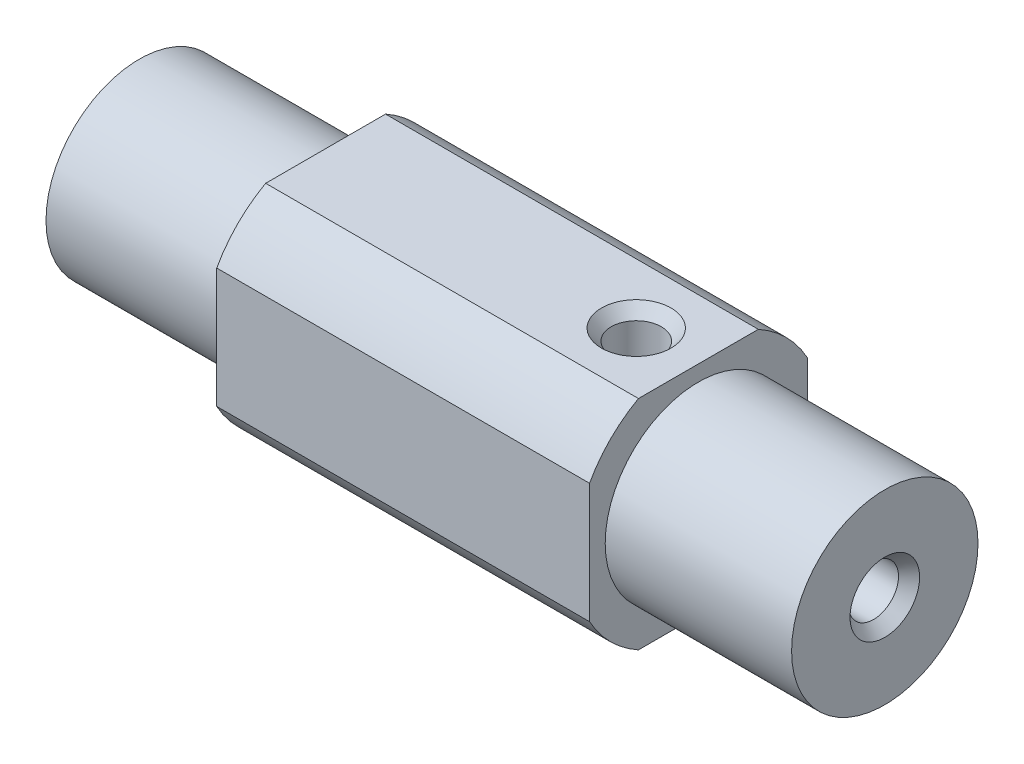
ISO-10303-21;
HEADER;
FILE_DESCRIPTION(('STEP AP214'),'2;1');
FILE_NAME('part.step','',(''),(''),'','','');
FILE_SCHEMA(('AUTOMOTIVE_DESIGN { 1 0 10303 214 1 1 1 1 }'));
ENDSEC;
DATA;
#1=APPLICATION_CONTEXT('core data for automotive mechanical design processes');
#2=APPLICATION_PROTOCOL_DEFINITION('international standard','automotive_design',2000,#1);
#3=PRODUCT_CONTEXT('',#1,'mechanical');
#4=PRODUCT('Part','Part','',(#3));
#5=PRODUCT_RELATED_PRODUCT_CATEGORY('part','',(#4));
#6=PRODUCT_DEFINITION_FORMATION('','',#4);
#7=PRODUCT_DEFINITION_CONTEXT('part definition',#1,'design');
#8=PRODUCT_DEFINITION('design','',#6,#7);
#9=PRODUCT_DEFINITION_SHAPE('','',#8);
#10=(LENGTH_UNIT() NAMED_UNIT(*) SI_UNIT(.MILLI.,.METRE.));
#11=(NAMED_UNIT(*) PLANE_ANGLE_UNIT() SI_UNIT($,.RADIAN.));
#12=(NAMED_UNIT(*) SI_UNIT($,.STERADIAN.) SOLID_ANGLE_UNIT());
#13=UNCERTAINTY_MEASURE_WITH_UNIT(LENGTH_MEASURE(1.E-05),#10,'distance_accuracy_value','');
#14=(GEOMETRIC_REPRESENTATION_CONTEXT(3) GLOBAL_UNCERTAINTY_ASSIGNED_CONTEXT((#13)) GLOBAL_UNIT_ASSIGNED_CONTEXT((#10,
#11,#12)) REPRESENTATION_CONTEXT('',''));
#15=CARTESIAN_POINT('',(0.,0.,0.));
#16=DIRECTION('',(0.,0.,1.));
#17=DIRECTION('',(1.,0.,0.));
#18=AXIS2_PLACEMENT_3D('',#15,#16,#17);
#19=CARTESIAN_POINT('',(-79.375,0.,0.));
#20=DIRECTION('',(1.,0.,0.));
#21=DIRECTION('',(0.,0.,-1.));
#22=AXIS2_PLACEMENT_3D('',#19,#20,#21);
#23=CYLINDRICAL_SURFACE('',#22,12.7);
#24=DIRECTION('',(1.,0.,0.));
#25=VECTOR('',#24,1.);
#26=CARTESIAN_POINT('',(-79.375,-6.12535100708523,11.1252));
#27=LINE('',#26,#25);
#28=CARTESIAN_POINT('',(-19.05,-6.12535100708523,11.1252));
#29=VERTEX_POINT('',#28);
#30=CARTESIAN_POINT('',(-57.15,-6.12535100708523,11.1252));
#31=VERTEX_POINT('',#30);
#32=EDGE_CURVE('E205',#29,#31,#27,.F.);
#33=ORIENTED_EDGE('',*,*,#32,.T.);
#34=CARTESIAN_POINT('',(-57.15,0.,0.));
#35=DIRECTION('',(-1.,0.,0.));
#36=DIRECTION('',(0.,0.,1.));
#37=AXIS2_PLACEMENT_3D('',#34,#35,#36);
#38=CIRCLE('',#37,12.7);
#39=CARTESIAN_POINT('',(-57.15,-11.1252,6.12535100708522));
#40=VERTEX_POINT('',#39);
#41=EDGE_CURVE('E154',#31,#40,#38,.F.);
#42=ORIENTED_EDGE('',*,*,#41,.T.);
#43=DIRECTION('',(1.,0.,0.));
#44=VECTOR('',#43,1.);
#45=CARTESIAN_POINT('',(-79.375,-11.1252,6.12535100708522));
#46=LINE('',#45,#44);
#47=CARTESIAN_POINT('',(-19.05,-11.1252,6.12535100708522));
#48=VERTEX_POINT('',#47);
#49=EDGE_CURVE('E177',#48,#40,#46,.F.);
#50=ORIENTED_EDGE('',*,*,#49,.F.);
#51=CARTESIAN_POINT('',(-19.05,0.,0.));
#52=DIRECTION('',(1.,0.,0.));
#53=DIRECTION('',(0.,0.,-1.));
#54=AXIS2_PLACEMENT_3D('',#51,#52,#53);
#55=CIRCLE('',#54,12.7);
#56=EDGE_CURVE('E212',#48,#29,#55,.F.);
#57=ORIENTED_EDGE('',*,*,#56,.T.);
#58=EDGE_LOOP('',(#33,#42,#50,#57));
#59=FACE_BOUND('',#58,.T.);
#60=ADVANCED_FACE('F48',(#59),#23,.T.);
#61=DIRECTION('',(1.,0.,0.));
#62=VECTOR('',#61,1.);
#63=CARTESIAN_POINT('',(-79.375,-11.1252,-6.12535100708522));
#64=LINE('',#63,#62);
#65=CARTESIAN_POINT('',(-57.15,-11.1252,-6.12535100708522));
#66=VERTEX_POINT('',#65);
#67=CARTESIAN_POINT('',(-19.05,-11.1252,-6.12535100708522));
#68=VERTEX_POINT('',#67);
#69=EDGE_CURVE('E68',#66,#68,#64,.T.);
#70=ORIENTED_EDGE('',*,*,#69,.F.);
#71=CARTESIAN_POINT('',(-57.15,0.,0.));
#72=DIRECTION('',(-1.,0.,0.));
#73=DIRECTION('',(0.,0.,1.));
#74=AXIS2_PLACEMENT_3D('',#71,#72,#73);
#75=CIRCLE('',#74,12.7);
#76=CARTESIAN_POINT('',(-57.15,-6.12535100708522,-11.1252));
#77=VERTEX_POINT('',#76);
#78=EDGE_CURVE('E61',#66,#77,#75,.F.);
#79=ORIENTED_EDGE('',*,*,#78,.T.);
#80=DIRECTION('',(1.,0.,0.));
#81=VECTOR('',#80,1.);
#82=CARTESIAN_POINT('',(-79.375,-6.12535100708522,-11.1252));
#83=LINE('',#82,#81);
#84=CARTESIAN_POINT('',(-19.05,-6.12535100708522,-11.1252));
#85=VERTEX_POINT('',#84);
#86=EDGE_CURVE('E173',#85,#77,#83,.F.);
#87=ORIENTED_EDGE('',*,*,#86,.F.);
#88=EDGE_CURVE('E238',#85,#68,#55,.F.);
#89=ORIENTED_EDGE('',*,*,#88,.T.);
#90=EDGE_LOOP('',(#70,#79,#87,#89));
#91=FACE_BOUND('',#90,.T.);
#92=ADVANCED_FACE('F252',(#91),#23,.T.);
#93=DIRECTION('',(1.,0.,0.));
#94=VECTOR('',#93,1.);
#95=CARTESIAN_POINT('',(-79.375,11.1252,6.12535100708523));
#96=LINE('',#95,#94);
#97=CARTESIAN_POINT('',(-19.05,11.1252,6.12535100708523));
#98=VERTEX_POINT('',#97);
#99=CARTESIAN_POINT('',(-57.15,11.1252,6.12535100708523));
#100=VERTEX_POINT('',#99);
#101=EDGE_CURVE('E200',#98,#100,#96,.F.);
#102=ORIENTED_EDGE('',*,*,#101,.T.);
#103=CARTESIAN_POINT('',(-57.15,0.,0.));
#104=DIRECTION('',(-1.,0.,0.));
#105=DIRECTION('',(0.,0.,1.));
#106=AXIS2_PLACEMENT_3D('',#103,#104,#105);
#107=CIRCLE('',#106,12.7);
#108=CARTESIAN_POINT('',(-57.15,6.12535100708522,11.1252));
#109=VERTEX_POINT('',#108);
#110=EDGE_CURVE('E165',#100,#109,#107,.F.);
#111=ORIENTED_EDGE('',*,*,#110,.T.);
#112=DIRECTION('',(1.,0.,0.));
#113=VECTOR('',#112,1.);
#114=CARTESIAN_POINT('',(-79.375,6.12535100708523,11.1252));
#115=LINE('',#114,#113);
#116=CARTESIAN_POINT('',(-19.05,6.12535100708523,11.1252));
#117=VERTEX_POINT('',#116);
#118=EDGE_CURVE('E203',#109,#117,#115,.T.);
#119=ORIENTED_EDGE('',*,*,#118,.T.);
#120=EDGE_CURVE('E215',#117,#98,#55,.F.);
#121=ORIENTED_EDGE('',*,*,#120,.T.);
#122=EDGE_LOOP('',(#102,#111,#119,#121));
#123=FACE_BOUND('',#122,.T.);
#124=ADVANCED_FACE('F254',(#123),#23,.T.);
#125=DIRECTION('',(1.,0.,0.));
#126=VECTOR('',#125,1.);
#127=CARTESIAN_POINT('',(-79.375,6.12535100708523,-11.1252));
#128=LINE('',#127,#126);
#129=CARTESIAN_POINT('',(-57.15,6.12535100708523,-11.1252));
#130=VERTEX_POINT('',#129);
#131=CARTESIAN_POINT('',(-19.05,6.12535100708523,-11.1252));
#132=VERTEX_POINT('',#131);
#133=EDGE_CURVE('E171',#130,#132,#128,.T.);
#134=ORIENTED_EDGE('',*,*,#133,.F.);
#135=CARTESIAN_POINT('',(-57.15,0.,0.));
#136=DIRECTION('',(-1.,0.,0.));
#137=DIRECTION('',(0.,0.,1.));
#138=AXIS2_PLACEMENT_3D('',#135,#136,#137);
#139=CIRCLE('',#138,12.7);
#140=CARTESIAN_POINT('',(-57.15,11.1252,-6.12535100708523));
#141=VERTEX_POINT('',#140);
#142=EDGE_CURVE('E162',#130,#141,#139,.F.);
#143=ORIENTED_EDGE('',*,*,#142,.T.);
#144=DIRECTION('',(1.,0.,0.));
#145=VECTOR('',#144,1.);
#146=CARTESIAN_POINT('',(-79.375,11.1252,-6.12535100708523));
#147=LINE('',#146,#145);
#148=CARTESIAN_POINT('',(-19.05,11.1252,-6.12535100708523));
#149=VERTEX_POINT('',#148);
#150=EDGE_CURVE('E198',#141,#149,#147,.T.);
#151=ORIENTED_EDGE('',*,*,#150,.T.);
#152=EDGE_CURVE('E219',#149,#132,#55,.F.);
#153=ORIENTED_EDGE('',*,*,#152,.T.);
#154=EDGE_LOOP('',(#134,#143,#151,#153));
#155=FACE_BOUND('',#154,.T.);
#156=ADVANCED_FACE('F245',(#155),#23,.T.);
#157=CARTESIAN_POINT('',(-91.2436173816218,-25.5220707846333,11.1252));
#158=DIRECTION('',(0.,0.,1.));
#159=DIRECTION('',(1.,0.,0.));
#160=AXIS2_PLACEMENT_3D('',#157,#158,#159);
#161=PLANE('',#160);
#162=ORIENTED_EDGE('',*,*,#118,.F.);
#163=DIRECTION('',(0.,-1.,0.));
#164=VECTOR('',#163,1.);
#165=CARTESIAN_POINT('',(-57.15,-25.5220707846333,11.1252));
#166=LINE('',#165,#164);
#167=EDGE_CURVE('E159',#109,#31,#166,.T.);
#168=ORIENTED_EDGE('',*,*,#167,.T.);
#169=ORIENTED_EDGE('',*,*,#32,.F.);
#170=DIRECTION('',(0.,-1.,0.));
#171=VECTOR('',#170,1.);
#172=CARTESIAN_POINT('',(-19.05,0.,11.1252));
#173=LINE('',#172,#171);
#174=EDGE_CURVE('E218',#117,#29,#173,.T.);
#175=ORIENTED_EDGE('',*,*,#174,.F.);
#176=EDGE_LOOP('',(#162,#168,#169,#175));
#177=FACE_BOUND('',#176,.T.);
#178=ADVANCED_FACE('F263',(#177),#161,.T.);
#179=CARTESIAN_POINT('',(-96.4133134907001,11.1252,24.8096946684768));
#180=DIRECTION('',(0.,1.,0.));
#181=DIRECTION('',(0.,0.,1.));
#182=AXIS2_PLACEMENT_3D('',#179,#180,#181);
#183=PLANE('',#182);
#184=CARTESIAN_POINT('',(-25.4,11.1252000000001,0.));
#185=DIRECTION('',(0.,1.,0.));
#186=DIRECTION('',(0.,0.,1.));
#187=AXIS2_PLACEMENT_3D('',#184,#185,#186);
#188=CIRCLE('',#187,3.55599999999989);
#189=CARTESIAN_POINT('',(-25.4,11.1252000000001,3.55599999999989));
#190=VERTEX_POINT('',#189);
#191=EDGE_CURVE('E189',#190,#190,#188,.T.);
#192=ORIENTED_EDGE('',*,*,#191,.F.);
#193=EDGE_LOOP('',(#192));
#194=FACE_BOUND('',#193,.T.);
#195=ORIENTED_EDGE('',*,*,#150,.F.);
#196=DIRECTION('',(0.,0.,1.));
#197=VECTOR('',#196,1.);
#198=CARTESIAN_POINT('',(-57.15,11.1252,24.8096946684768));
#199=LINE('',#198,#197);
#200=EDGE_CURVE('E168',#141,#100,#199,.T.);
#201=ORIENTED_EDGE('',*,*,#200,.T.);
#202=ORIENTED_EDGE('',*,*,#101,.F.);
#203=DIRECTION('',(0.,0.,1.));
#204=VECTOR('',#203,1.);
#205=CARTESIAN_POINT('',(-19.05,11.1252,0.));
#206=LINE('',#205,#204);
#207=EDGE_CURVE('E222',#149,#98,#206,.T.);
#208=ORIENTED_EDGE('',*,*,#207,.F.);
#209=EDGE_LOOP('',(#195,#201,#202,#208));
#210=FACE_BOUND('',#209,.T.);
#211=ADVANCED_FACE('F267',(#194,#210),#183,.T.);
#212=CARTESIAN_POINT('',(-88.9,12.0776267868952,-11.1252));
#213=DIRECTION('',(0.,0.,1.));
#214=DIRECTION('',(0.,-1.,0.));
#215=AXIS2_PLACEMENT_3D('',#212,#213,#214);
#216=PLANE('',#215);
#217=DIRECTION('',(0.,-1.,0.));
#218=VECTOR('',#217,1.);
#219=CARTESIAN_POINT('',(-57.15,12.0776267868952,-11.1252));
#220=LINE('',#219,#218);
#221=EDGE_CURVE('E157',#130,#77,#220,.T.);
#222=ORIENTED_EDGE('',*,*,#221,.F.);
#223=ORIENTED_EDGE('',*,*,#133,.T.);
#224=DIRECTION('',(0.,-1.,0.));
#225=VECTOR('',#224,1.);
#226=CARTESIAN_POINT('',(-19.05,0.,-11.1252));
#227=LINE('',#226,#225);
#228=EDGE_CURVE('E225',#132,#85,#227,.T.);
#229=ORIENTED_EDGE('',*,*,#228,.T.);
#230=ORIENTED_EDGE('',*,*,#86,.T.);
#231=EDGE_LOOP('',(#222,#223,#229,#230));
#232=FACE_BOUND('',#231,.T.);
#233=ADVANCED_FACE('F251',(#232),#216,.F.);
#234=CARTESIAN_POINT('',(-88.9,-11.1252,14.1212392114396));
#235=DIRECTION('',(0.,1.,0.));
#236=DIRECTION('',(0.,0.,1.));
#237=AXIS2_PLACEMENT_3D('',#234,#235,#236);
#238=PLANE('',#237);
#239=CARTESIAN_POINT('',(-50.8,-11.1252,0.));
#240=DIRECTION('',(0.,-1.,0.));
#241=DIRECTION('',(0.,0.,-1.));
#242=AXIS2_PLACEMENT_3D('',#239,#240,#241);
#243=CIRCLE('',#242,3.556);
#244=CARTESIAN_POINT('',(-50.8,-11.1252,-3.55600000000001));
#245=VERTEX_POINT('',#244);
#246=EDGE_CURVE('E138',#245,#245,#243,.T.);
#247=ORIENTED_EDGE('',*,*,#246,.F.);
#248=EDGE_LOOP('',(#247));
#249=FACE_BOUND('',#248,.T.);
#250=DIRECTION('',(0.,0.,1.));
#251=VECTOR('',#250,1.);
#252=CARTESIAN_POINT('',(-57.15,-11.1252,14.1212392114396));
#253=LINE('',#252,#251);
#254=EDGE_CURVE('E13',#66,#40,#253,.T.);
#255=ORIENTED_EDGE('',*,*,#254,.F.);
#256=ORIENTED_EDGE('',*,*,#69,.T.);
#257=DIRECTION('',(0.,0.,1.));
#258=VECTOR('',#257,1.);
#259=CARTESIAN_POINT('',(-19.05,-11.1252,0.));
#260=LINE('',#259,#258);
#261=EDGE_CURVE('E55',#68,#48,#260,.T.);
#262=ORIENTED_EDGE('',*,*,#261,.T.);
#263=ORIENTED_EDGE('',*,*,#49,.T.);
#264=EDGE_LOOP('',(#255,#256,#262,#263));
#265=FACE_BOUND('',#264,.T.);
#266=ADVANCED_FACE('F227',(#249,#265),#238,.F.);
#267=CARTESIAN_POINT('',(-19.05,0.,0.));
#268=DIRECTION('',(1.,0.,0.));
#269=DIRECTION('',(0.,0.,-1.));
#270=AXIS2_PLACEMENT_3D('',#267,#268,#269);
#271=PLANE('',#270);
#272=ORIENTED_EDGE('',*,*,#261,.F.);
#273=ORIENTED_EDGE('',*,*,#88,.F.);
#274=ORIENTED_EDGE('',*,*,#228,.F.);
#275=ORIENTED_EDGE('',*,*,#152,.F.);
#276=ORIENTED_EDGE('',*,*,#207,.T.);
#277=ORIENTED_EDGE('',*,*,#120,.F.);
#278=ORIENTED_EDGE('',*,*,#174,.T.);
#279=ORIENTED_EDGE('',*,*,#56,.F.);
#280=EDGE_LOOP('',(#272,#273,#274,#275,#276,#277,#278,#279));
#281=FACE_BOUND('',#280,.T.);
#282=CARTESIAN_POINT('',(-19.05,0.,0.));
#283=DIRECTION('',(1.,0.,0.));
#284=DIRECTION('',(0.,0.,-1.));
#285=AXIS2_PLACEMENT_3D('',#282,#283,#284);
#286=CIRCLE('',#285,9.525);
#287=CARTESIAN_POINT('',(-19.05,0.,-9.525));
#288=VERTEX_POINT('',#287);
#289=EDGE_CURVE('E209',#288,#288,#286,.T.);
#290=ORIENTED_EDGE('',*,*,#289,.F.);
#291=EDGE_LOOP('',(#290));
#292=FACE_BOUND('',#291,.T.);
#293=ADVANCED_FACE('F234',(#281,#292),#271,.T.);
#294=CARTESIAN_POINT('',(-19.05,0.,0.));
#295=DIRECTION('',(1.,0.,0.));
#296=DIRECTION('',(0.,0.,-1.));
#297=AXIS2_PLACEMENT_3D('',#294,#295,#296);
#298=CYLINDRICAL_SURFACE('',#297,9.525);
#299=ORIENTED_EDGE('',*,*,#289,.T.);
#300=EDGE_LOOP('',(#299));
#301=FACE_BOUND('',#300,.T.);
#302=CARTESIAN_POINT('',(0.,0.,0.));
#303=DIRECTION('',(1.,0.,0.));
#304=DIRECTION('',(0.,0.,-1.));
#305=AXIS2_PLACEMENT_3D('',#302,#303,#304);
#306=CIRCLE('',#305,9.525);
#307=CARTESIAN_POINT('',(0.,0.,-9.525));
#308=VERTEX_POINT('',#307);
#309=EDGE_CURVE('E208',#308,#308,#306,.T.);
#310=ORIENTED_EDGE('',*,*,#309,.F.);
#311=EDGE_LOOP('',(#310));
#312=FACE_BOUND('',#311,.T.);
#313=ADVANCED_FACE('F278',(#301,#312),#298,.T.);
#314=CARTESIAN_POINT('',(0.,0.,0.));
#315=DIRECTION('',(1.,0.,0.));
#316=DIRECTION('',(0.,0.,-1.));
#317=AXIS2_PLACEMENT_3D('',#314,#315,#316);
#318=PLANE('',#317);
#319=CARTESIAN_POINT('',(0.,0.,0.));
#320=DIRECTION('',(1.,0.,0.));
#321=DIRECTION('',(0.,0.,-1.));
#322=AXIS2_PLACEMENT_3D('',#319,#320,#321);
#323=CIRCLE('',#322,3.556);
#324=CARTESIAN_POINT('',(0.,0.,-3.556));
#325=VERTEX_POINT('',#324);
#326=EDGE_CURVE('E180',#325,#325,#323,.T.);
#327=ORIENTED_EDGE('',*,*,#326,.F.);
#328=EDGE_LOOP('',(#327));
#329=FACE_BOUND('',#328,.T.);
#330=ORIENTED_EDGE('',*,*,#309,.T.);
#331=EDGE_LOOP('',(#330));
#332=FACE_BOUND('',#331,.T.);
#333=ADVANCED_FACE('F281',(#329,#332),#318,.T.);
#334=CARTESIAN_POINT('',(-25.4,-4.8768,0.));
#335=DIRECTION('',(0.,1.,0.));
#336=DIRECTION('',(0.,0.,1.));
#337=AXIS2_PLACEMENT_3D('',#334,#335,#336);
#338=CONICAL_SURFACE('',#337,2.5527,1.02974425867665);
#339=CARTESIAN_POINT('',(-25.4,-6.41061690219165,0.));
#340=VERTEX_POINT('',#339);
#341=VERTEX_LOOP('',#340);
#342=FACE_BOUND('',#341,.T.);
#343=CARTESIAN_POINT('',(-25.4,-4.8768,0.));
#344=DIRECTION('',(0.,1.,0.));
#345=DIRECTION('',(0.,0.,1.));
#346=AXIS2_PLACEMENT_3D('',#343,#344,#345);
#347=CIRCLE('',#346,2.5527);
#348=CARTESIAN_POINT('',(-25.4,-4.8768,2.5527));
#349=VERTEX_POINT('',#348);
#350=EDGE_CURVE('E195',#349,#349,#347,.T.);
#351=ORIENTED_EDGE('',*,*,#350,.T.);
#352=EDGE_LOOP('',(#351));
#353=FACE_BOUND('',#352,.T.);
#354=ADVANCED_FACE('F285',(#342,#353),#338,.F.);
#355=CARTESIAN_POINT('',(-25.4,11.1252,0.));
#356=DIRECTION('',(0.,1.,0.));
#357=DIRECTION('',(0.,0.,1.));
#358=AXIS2_PLACEMENT_3D('',#355,#356,#357);
#359=CYLINDRICAL_SURFACE('',#358,2.5527);
#360=ORIENTED_EDGE('',*,*,#350,.F.);
#361=EDGE_LOOP('',(#360));
#362=FACE_BOUND('',#361,.T.);
#363=CARTESIAN_POINT('',(-25.4,9.9710353770342,0.));
#364=DIRECTION('',(0.,1.,0.));
#365=DIRECTION('',(0.,0.,1.));
#366=AXIS2_PLACEMENT_3D('',#363,#364,#365);
#367=CIRCLE('',#366,2.5527);
#368=CARTESIAN_POINT('',(-25.4,9.9710353770342,2.5527));
#369=VERTEX_POINT('',#368);
#370=EDGE_CURVE('E192',#369,#369,#367,.T.);
#371=ORIENTED_EDGE('',*,*,#370,.T.);
#372=EDGE_LOOP('',(#371));
#373=FACE_BOUND('',#372,.T.);
#374=ADVANCED_FACE('F290',(#362,#373),#359,.F.);
#375=CARTESIAN_POINT('',(-25.4,11.1252000000001,0.));
#376=DIRECTION('',(0.,1.,0.));
#377=DIRECTION('',(0.,0.,1.));
#378=AXIS2_PLACEMENT_3D('',#375,#376,#377);
#379=CONICAL_SURFACE('',#378,3.55599999999989,0.715584993317153);
#380=ORIENTED_EDGE('',*,*,#370,.F.);
#381=EDGE_LOOP('',(#380));
#382=FACE_BOUND('',#381,.T.);
#383=ORIENTED_EDGE('',*,*,#191,.T.);
#384=EDGE_LOOP('',(#383));
#385=FACE_BOUND('',#384,.T.);
#386=ADVANCED_FACE('F318',(#382,#385),#379,.F.);
#387=CARTESIAN_POINT('',(-16.002,0.,0.));
#388=DIRECTION('',(1.,0.,0.));
#389=DIRECTION('',(0.,0.,-1.));
#390=AXIS2_PLACEMENT_3D('',#387,#388,#389);
#391=CONICAL_SURFACE('',#390,2.5527,1.02974425867665);
#392=CARTESIAN_POINT('',(-17.5358169021917,0.,0.));
#393=VERTEX_POINT('',#392);
#394=VERTEX_LOOP('',#393);
#395=FACE_BOUND('',#394,.T.);
#396=CARTESIAN_POINT('',(-16.002,0.,0.));
#397=DIRECTION('',(1.,0.,0.));
#398=DIRECTION('',(0.,0.,-1.));
#399=AXIS2_PLACEMENT_3D('',#396,#397,#398);
#400=CIRCLE('',#399,2.5527);
#401=CARTESIAN_POINT('',(-16.002,0.,-2.5527));
#402=VERTEX_POINT('',#401);
#403=EDGE_CURVE('E186',#402,#402,#400,.T.);
#404=ORIENTED_EDGE('',*,*,#403,.T.);
#405=EDGE_LOOP('',(#404));
#406=FACE_BOUND('',#405,.T.);
#407=ADVANCED_FACE('F309',(#395,#406),#391,.F.);
#408=CARTESIAN_POINT('',(0.,0.,0.));
#409=DIRECTION('',(1.,0.,0.));
#410=DIRECTION('',(0.,0.,-1.));
#411=AXIS2_PLACEMENT_3D('',#408,#409,#410);
#412=CYLINDRICAL_SURFACE('',#411,2.55269999999999);
#413=ORIENTED_EDGE('',*,*,#403,.F.);
#414=EDGE_LOOP('',(#413));
#415=FACE_BOUND('',#414,.T.);
#416=CARTESIAN_POINT('',(-1.15416462296485,0.,0.));
#417=DIRECTION('',(1.,0.,0.));
#418=DIRECTION('',(0.,0.,-1.));
#419=AXIS2_PLACEMENT_3D('',#416,#417,#418);
#420=CIRCLE('',#419,2.55269999999999);
#421=CARTESIAN_POINT('',(-1.15416462296485,0.,-2.55269999999999));
#422=VERTEX_POINT('',#421);
#423=EDGE_CURVE('E183',#422,#422,#420,.T.);
#424=ORIENTED_EDGE('',*,*,#423,.T.);
#425=EDGE_LOOP('',(#424));
#426=FACE_BOUND('',#425,.T.);
#427=ADVANCED_FACE('F300',(#415,#426),#412,.F.);
#428=CARTESIAN_POINT('',(0.,0.,0.));
#429=DIRECTION('',(1.,0.,0.));
#430=DIRECTION('',(0.,0.,-1.));
#431=AXIS2_PLACEMENT_3D('',#428,#429,#430);
#432=CONICAL_SURFACE('',#431,3.556,0.715584993317677);
#433=ORIENTED_EDGE('',*,*,#423,.F.);
#434=EDGE_LOOP('',(#433));
#435=FACE_BOUND('',#434,.T.);
#436=ORIENTED_EDGE('',*,*,#326,.T.);
#437=EDGE_LOOP('',(#436));
#438=FACE_BOUND('',#437,.T.);
#439=ADVANCED_FACE('F297',(#435,#438),#432,.F.);
#440=CARTESIAN_POINT('',(-57.15,0.,0.));
#441=DIRECTION('',(-1.,0.,0.));
#442=DIRECTION('',(0.,0.,1.));
#443=AXIS2_PLACEMENT_3D('',#440,#441,#442);
#444=PLANE('',#443);
#445=ORIENTED_EDGE('',*,*,#142,.F.);
#446=ORIENTED_EDGE('',*,*,#221,.T.);
#447=ORIENTED_EDGE('',*,*,#78,.F.);
#448=ORIENTED_EDGE('',*,*,#254,.T.);
#449=ORIENTED_EDGE('',*,*,#41,.F.);
#450=ORIENTED_EDGE('',*,*,#167,.F.);
#451=ORIENTED_EDGE('',*,*,#110,.F.);
#452=ORIENTED_EDGE('',*,*,#200,.F.);
#453=EDGE_LOOP('',(#445,#446,#447,#448,#449,#450,#451,#452));
#454=FACE_BOUND('',#453,.T.);
#455=CARTESIAN_POINT('',(-57.15,0.,0.));
#456=DIRECTION('',(-1.,0.,0.));
#457=DIRECTION('',(0.,0.,1.));
#458=AXIS2_PLACEMENT_3D('',#455,#456,#457);
#459=CIRCLE('',#458,9.525);
#460=CARTESIAN_POINT('',(-57.15,0.,9.525));
#461=VERTEX_POINT('',#460);
#462=EDGE_CURVE('E148',#461,#461,#459,.T.);
#463=ORIENTED_EDGE('',*,*,#462,.F.);
#464=EDGE_LOOP('',(#463));
#465=FACE_BOUND('',#464,.T.);
#466=ADVANCED_FACE('F299',(#454,#465),#444,.T.);
#467=CARTESIAN_POINT('',(-57.15,0.,0.));
#468=DIRECTION('',(-1.,0.,0.));
#469=DIRECTION('',(0.,0.,1.));
#470=AXIS2_PLACEMENT_3D('',#467,#468,#469);
#471=CYLINDRICAL_SURFACE('',#470,9.525);
#472=ORIENTED_EDGE('',*,*,#462,.T.);
#473=EDGE_LOOP('',(#472));
#474=FACE_BOUND('',#473,.T.);
#475=CARTESIAN_POINT('',(-76.2,0.,0.));
#476=DIRECTION('',(-1.,0.,0.));
#477=DIRECTION('',(0.,0.,1.));
#478=AXIS2_PLACEMENT_3D('',#475,#476,#477);
#479=CIRCLE('',#478,9.525);
#480=CARTESIAN_POINT('',(-76.2,0.,9.525));
#481=VERTEX_POINT('',#480);
#482=EDGE_CURVE('E147',#481,#481,#479,.T.);
#483=ORIENTED_EDGE('',*,*,#482,.F.);
#484=EDGE_LOOP('',(#483));
#485=FACE_BOUND('',#484,.T.);
#486=ADVANCED_FACE('F307',(#474,#485),#471,.T.);
#487=CARTESIAN_POINT('',(-76.2,0.,0.));
#488=DIRECTION('',(-1.,0.,0.));
#489=DIRECTION('',(0.,0.,1.));
#490=AXIS2_PLACEMENT_3D('',#487,#488,#489);
#491=PLANE('',#490);
#492=CARTESIAN_POINT('',(-76.2,0.,0.));
#493=DIRECTION('',(-1.,0.,0.));
#494=DIRECTION('',(0.,0.,1.));
#495=AXIS2_PLACEMENT_3D('',#492,#493,#494);
#496=CIRCLE('',#495,3.556);
#497=CARTESIAN_POINT('',(-76.2,0.,3.556));
#498=VERTEX_POINT('',#497);
#499=EDGE_CURVE('E131',#498,#498,#496,.T.);
#500=ORIENTED_EDGE('',*,*,#499,.F.);
#501=EDGE_LOOP('',(#500));
#502=FACE_BOUND('',#501,.T.);
#503=ORIENTED_EDGE('',*,*,#482,.T.);
#504=EDGE_LOOP('',(#503));
#505=FACE_BOUND('',#504,.T.);
#506=ADVANCED_FACE('F338',(#502,#505),#491,.T.);
#507=CARTESIAN_POINT('',(-60.198,0.,0.));
#508=DIRECTION('',(-1.,0.,0.));
#509=DIRECTION('',(0.,0.,1.));
#510=AXIS2_PLACEMENT_3D('',#507,#508,#509);
#511=CONICAL_SURFACE('',#510,2.5527,1.02974425867665);
#512=CARTESIAN_POINT('',(-58.6641830978084,0.,0.));
#513=VERTEX_POINT('',#512);
#514=VERTEX_LOOP('',#513);
#515=FACE_BOUND('',#514,.T.);
#516=CARTESIAN_POINT('',(-60.198,0.,0.));
#517=DIRECTION('',(-1.,0.,0.));
#518=DIRECTION('',(0.,0.,1.));
#519=AXIS2_PLACEMENT_3D('',#516,#517,#518);
#520=CIRCLE('',#519,2.5527);
#521=CARTESIAN_POINT('',(-60.198,0.,2.5527));
#522=VERTEX_POINT('',#521);
#523=EDGE_CURVE('E144',#522,#522,#520,.T.);
#524=ORIENTED_EDGE('',*,*,#523,.T.);
#525=EDGE_LOOP('',(#524));
#526=FACE_BOUND('',#525,.T.);
#527=ADVANCED_FACE('F343',(#515,#526),#511,.F.);
#528=CARTESIAN_POINT('',(-76.2,0.,0.));
#529=DIRECTION('',(-1.,0.,0.));
#530=DIRECTION('',(0.,0.,1.));
#531=AXIS2_PLACEMENT_3D('',#528,#529,#530);
#532=CYLINDRICAL_SURFACE('',#531,2.55269999999999);
#533=ORIENTED_EDGE('',*,*,#523,.F.);
#534=EDGE_LOOP('',(#533));
#535=FACE_BOUND('',#534,.T.);
#536=CARTESIAN_POINT('',(-75.0458353770352,0.,0.));
#537=DIRECTION('',(-1.,0.,0.));
#538=DIRECTION('',(0.,0.,1.));
#539=AXIS2_PLACEMENT_3D('',#536,#537,#538);
#540=CIRCLE('',#539,2.55269999999999);
#541=CARTESIAN_POINT('',(-75.0458353770352,0.,2.55269999999999));
#542=VERTEX_POINT('',#541);
#543=EDGE_CURVE('E135',#542,#542,#540,.T.);
#544=ORIENTED_EDGE('',*,*,#543,.T.);
#545=EDGE_LOOP('',(#544));
#546=FACE_BOUND('',#545,.T.);
#547=ADVANCED_FACE('F349',(#535,#546),#532,.F.);
#548=CARTESIAN_POINT('',(-76.2,0.,0.));
#549=DIRECTION('',(-1.,0.,0.));
#550=DIRECTION('',(0.,0.,1.));
#551=AXIS2_PLACEMENT_3D('',#548,#549,#550);
#552=CONICAL_SURFACE('',#551,3.556,0.715584993317678);
#553=ORIENTED_EDGE('',*,*,#543,.F.);
#554=EDGE_LOOP('',(#553));
#555=FACE_BOUND('',#554,.T.);
#556=ORIENTED_EDGE('',*,*,#499,.T.);
#557=EDGE_LOOP('',(#556));
#558=FACE_BOUND('',#557,.T.);
#559=ADVANCED_FACE('F125',(#555,#558),#552,.F.);
#560=CARTESIAN_POINT('',(-50.8,4.8768,0.));
#561=DIRECTION('',(0.,-1.,0.));
#562=DIRECTION('',(0.,0.,-1.));
#563=AXIS2_PLACEMENT_3D('',#560,#561,#562);
#564=CONICAL_SURFACE('',#563,2.5527,1.02974425867665);
#565=CARTESIAN_POINT('',(-50.8,6.41061690219165,0.));
#566=VERTEX_POINT('',#565);
#567=VERTEX_LOOP('',#566);
#568=FACE_BOUND('',#567,.T.);
#569=CARTESIAN_POINT('',(-50.8,4.8768,0.));
#570=DIRECTION('',(0.,-1.,0.));
#571=DIRECTION('',(0.,0.,-1.));
#572=AXIS2_PLACEMENT_3D('',#569,#570,#571);
#573=CIRCLE('',#572,2.5527);
#574=CARTESIAN_POINT('',(-50.8,4.8768,-2.5527));
#575=VERTEX_POINT('',#574);
#576=EDGE_CURVE('E129',#575,#575,#573,.T.);
#577=ORIENTED_EDGE('',*,*,#576,.T.);
#578=EDGE_LOOP('',(#577));
#579=FACE_BOUND('',#578,.T.);
#580=ADVANCED_FACE('F121',(#568,#579),#564,.F.);
#581=CARTESIAN_POINT('',(-50.8,-11.1252,0.));
#582=DIRECTION('',(0.,-1.,0.));
#583=DIRECTION('',(0.,0.,-1.));
#584=AXIS2_PLACEMENT_3D('',#581,#582,#583);
#585=CYLINDRICAL_SURFACE('',#584,2.5527);
#586=ORIENTED_EDGE('',*,*,#576,.F.);
#587=EDGE_LOOP('',(#586));
#588=FACE_BOUND('',#587,.T.);
#589=CARTESIAN_POINT('',(-50.8,-9.97103537703516,0.));
#590=DIRECTION('',(0.,-1.,0.));
#591=DIRECTION('',(0.,0.,-1.));
#592=AXIS2_PLACEMENT_3D('',#589,#590,#591);
#593=CIRCLE('',#592,2.5527);
#594=CARTESIAN_POINT('',(-50.8,-9.97103537703516,-2.5527));
#595=VERTEX_POINT('',#594);
#596=EDGE_CURVE('E132',#595,#595,#593,.T.);
#597=ORIENTED_EDGE('',*,*,#596,.T.);
#598=EDGE_LOOP('',(#597));
#599=FACE_BOUND('',#598,.T.);
#600=ADVANCED_FACE('F124',(#588,#599),#585,.F.);
#601=CARTESIAN_POINT('',(-50.8,-11.1252,0.));
#602=DIRECTION('',(0.,-1.,0.));
#603=DIRECTION('',(0.,0.,-1.));
#604=AXIS2_PLACEMENT_3D('',#601,#602,#603);
#605=CONICAL_SURFACE('',#604,3.556,0.715584993317674);
#606=ORIENTED_EDGE('',*,*,#596,.F.);
#607=EDGE_LOOP('',(#606));
#608=FACE_BOUND('',#607,.T.);
#609=ORIENTED_EDGE('',*,*,#246,.T.);
#610=EDGE_LOOP('',(#609));
#611=FACE_BOUND('',#610,.T.);
#612=ADVANCED_FACE('F361',(#608,#611),#605,.F.);
#613=CLOSED_SHELL('',(#60,#92,#124,#156,#178,#211,#233,#266,#293,#313,#333,#354,#374,#386,#407,
#427,#439,#466,#486,#506,#527,#547,#559,#580,#600,#612));
#614=MANIFOLD_SOLID_BREP('B2',#613);
#615=ADVANCED_BREP_SHAPE_REPRESENTATION('',(#18,#614),#14);
#616=SHAPE_DEFINITION_REPRESENTATION(#9,#615);
ENDSEC;
END-ISO-10303-21;
